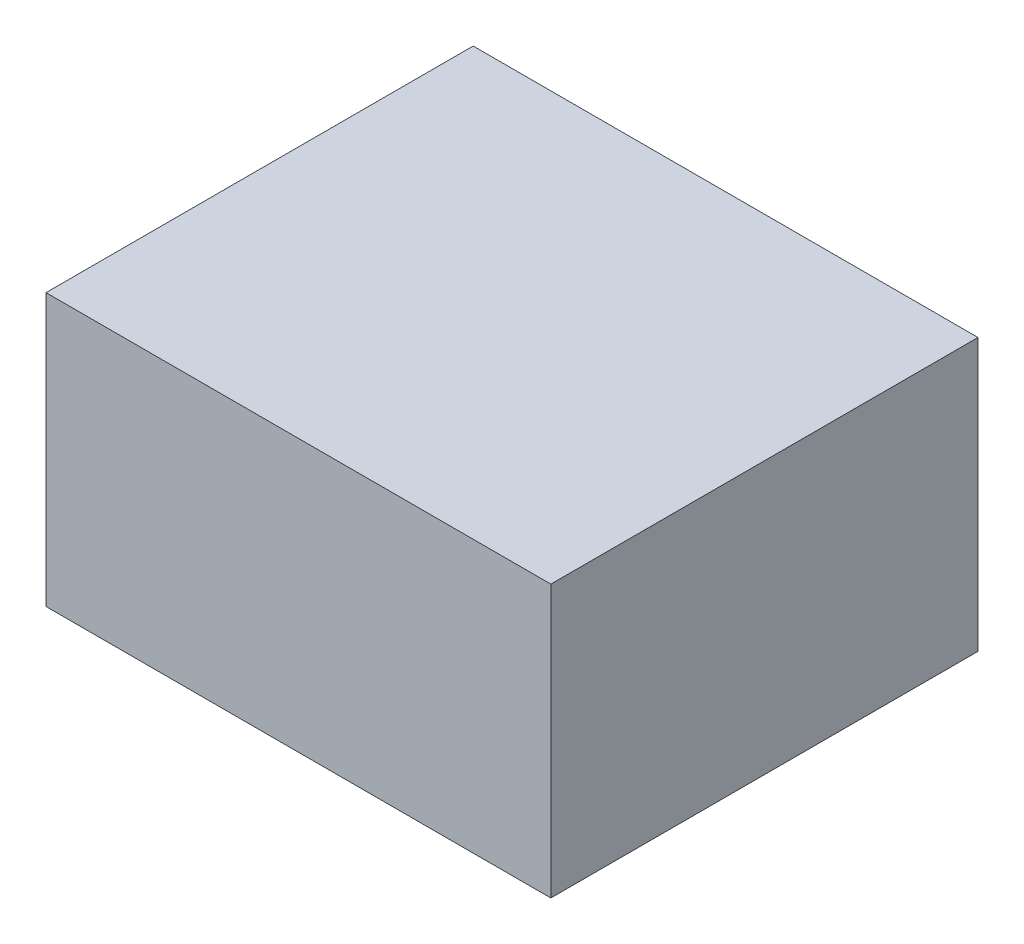
ISO-10303-21;
HEADER;
FILE_DESCRIPTION(('STEP AP214'),'2;1');
FILE_NAME('part.step','',(''),(''),'','','');
FILE_SCHEMA(('AUTOMOTIVE_DESIGN { 1 0 10303 214 1 1 1 1 }'));
ENDSEC;
DATA;
#1=APPLICATION_CONTEXT('core data for automotive mechanical design processes');
#2=APPLICATION_PROTOCOL_DEFINITION('international standard','automotive_design',2000,#1);
#3=PRODUCT_CONTEXT('',#1,'mechanical');
#4=PRODUCT('Part','Part','',(#3));
#5=PRODUCT_RELATED_PRODUCT_CATEGORY('part','',(#4));
#6=PRODUCT_DEFINITION_FORMATION('','',#4);
#7=PRODUCT_DEFINITION_CONTEXT('part definition',#1,'design');
#8=PRODUCT_DEFINITION('design','',#6,#7);
#9=PRODUCT_DEFINITION_SHAPE('','',#8);
#10=(LENGTH_UNIT() NAMED_UNIT(*) SI_UNIT(.MILLI.,.METRE.));
#11=(NAMED_UNIT(*) PLANE_ANGLE_UNIT() SI_UNIT($,.RADIAN.));
#12=(NAMED_UNIT(*) SI_UNIT($,.STERADIAN.) SOLID_ANGLE_UNIT());
#13=UNCERTAINTY_MEASURE_WITH_UNIT(LENGTH_MEASURE(1.E-05),#10,'distance_accuracy_value','');
#14=(GEOMETRIC_REPRESENTATION_CONTEXT(3) GLOBAL_UNCERTAINTY_ASSIGNED_CONTEXT((#13)) GLOBAL_UNIT_ASSIGNED_CONTEXT((#10,
#11,#12)) REPRESENTATION_CONTEXT('',''));
#15=CARTESIAN_POINT('',(0.,0.,0.));
#16=DIRECTION('',(0.,0.,1.));
#17=DIRECTION('',(1.,0.,0.));
#18=AXIS2_PLACEMENT_3D('',#15,#16,#17);
#19=CARTESIAN_POINT('',(0.32500062,0.17500092,0.));
#20=DIRECTION('',(0.,-1.,0.));
#21=DIRECTION('',(0.,0.,-1.));
#22=AXIS2_PLACEMENT_3D('',#19,#20,#21);
#23=PLANE('',#22);
#24=DIRECTION('',(0.,0.,-1.));
#25=VECTOR('',#24,1.);
#26=CARTESIAN_POINT('',(-0.32500062,0.17500092,0.));
#27=LINE('',#26,#25);
#28=CARTESIAN_POINT('',(-0.32500062,0.17500092,0.));
#29=VERTEX_POINT('',#28);
#30=CARTESIAN_POINT('',(-0.32500062,0.17500092,0.5499989));
#31=VERTEX_POINT('',#30);
#32=EDGE_CURVE('E19',#29,#31,#27,.F.);
#33=ORIENTED_EDGE('',*,*,#32,.T.);
#34=DIRECTION('',(-1.,0.,0.));
#35=VECTOR('',#34,1.);
#36=CARTESIAN_POINT('',(-0.32500062,0.17500092,0.5499989));
#37=LINE('',#36,#35);
#38=CARTESIAN_POINT('',(0.32500062,0.17500092,0.5499989));
#39=VERTEX_POINT('',#38);
#40=EDGE_CURVE('E54',#31,#39,#37,.F.);
#41=ORIENTED_EDGE('',*,*,#40,.T.);
#42=DIRECTION('',(0.,0.,1.));
#43=VECTOR('',#42,1.);
#44=CARTESIAN_POINT('',(0.32500062,0.17500092,0.));
#45=LINE('',#44,#43);
#46=CARTESIAN_POINT('',(0.32500062,0.17500092,0.));
#47=VERTEX_POINT('',#46);
#48=EDGE_CURVE('E75',#39,#47,#45,.F.);
#49=ORIENTED_EDGE('',*,*,#48,.T.);
#50=DIRECTION('',(-1.,0.,0.));
#51=VECTOR('',#50,1.);
#52=CARTESIAN_POINT('',(-0.32500062,0.17500092,0.));
#53=LINE('',#52,#51);
#54=EDGE_CURVE('E57',#29,#47,#53,.F.);
#55=ORIENTED_EDGE('',*,*,#54,.F.);
#56=EDGE_LOOP('',(#33,#41,#49,#55));
#57=FACE_BOUND('',#56,.T.);
#58=ADVANCED_FACE('F16',(#57),#23,.F.);
#59=CARTESIAN_POINT('',(-0.32500062,0.17500092,0.));
#60=DIRECTION('',(1.,0.,0.));
#61=DIRECTION('',(0.,0.,-1.));
#62=AXIS2_PLACEMENT_3D('',#59,#60,#61);
#63=PLANE('',#62);
#64=DIRECTION('',(0.,0.,1.));
#65=VECTOR('',#64,1.);
#66=CARTESIAN_POINT('',(-0.32500062,-0.17500092,0.));
#67=LINE('',#66,#65);
#68=CARTESIAN_POINT('',(-0.32500062,-0.17500092,0.));
#69=VERTEX_POINT('',#68);
#70=CARTESIAN_POINT('',(-0.32500062,-0.17500092,0.5499989));
#71=VERTEX_POINT('',#70);
#72=EDGE_CURVE('E72',#69,#71,#67,.T.);
#73=ORIENTED_EDGE('',*,*,#72,.T.);
#74=DIRECTION('',(0.,1.,0.));
#75=VECTOR('',#74,1.);
#76=CARTESIAN_POINT('',(-0.32500062,-0.17500092,0.5499989));
#77=LINE('',#76,#75);
#78=EDGE_CURVE('E62',#71,#31,#77,.T.);
#79=ORIENTED_EDGE('',*,*,#78,.T.);
#80=ORIENTED_EDGE('',*,*,#32,.F.);
#81=DIRECTION('',(0.,1.,0.));
#82=VECTOR('',#81,1.);
#83=CARTESIAN_POINT('',(-0.32500062,-0.17500092,0.));
#84=LINE('',#83,#82);
#85=EDGE_CURVE('E77',#69,#29,#84,.T.);
#86=ORIENTED_EDGE('',*,*,#85,.F.);
#87=EDGE_LOOP('',(#73,#79,#80,#86));
#88=FACE_BOUND('',#87,.T.);
#89=ADVANCED_FACE('F71',(#88),#63,.F.);
#90=CARTESIAN_POINT('',(-0.32500062,-0.17500092,0.5499989));
#91=DIRECTION('',(0.,0.,-1.));
#92=DIRECTION('',(-1.,0.,0.));
#93=AXIS2_PLACEMENT_3D('',#90,#91,#92);
#94=PLANE('',#93);
#95=DIRECTION('',(0.,1.,0.));
#96=VECTOR('',#95,1.);
#97=CARTESIAN_POINT('',(0.32500062,-0.17500092,0.5499989));
#98=LINE('',#97,#96);
#99=CARTESIAN_POINT('',(0.32500062,-0.17500092,0.5499989));
#100=VERTEX_POINT('',#99);
#101=EDGE_CURVE('E68',#100,#39,#98,.T.);
#102=ORIENTED_EDGE('',*,*,#101,.T.);
#103=ORIENTED_EDGE('',*,*,#40,.F.);
#104=ORIENTED_EDGE('',*,*,#78,.F.);
#105=DIRECTION('',(1.,0.,0.));
#106=VECTOR('',#105,1.);
#107=CARTESIAN_POINT('',(-0.32500062,-0.17500092,0.5499989));
#108=LINE('',#107,#106);
#109=EDGE_CURVE('E82',#71,#100,#108,.T.);
#110=ORIENTED_EDGE('',*,*,#109,.T.);
#111=EDGE_LOOP('',(#102,#103,#104,#110));
#112=FACE_BOUND('',#111,.T.);
#113=ADVANCED_FACE('F65',(#112),#94,.F.);
#114=CARTESIAN_POINT('',(0.32500062,-0.17500092,0.));
#115=DIRECTION('',(-1.,0.,0.));
#116=DIRECTION('',(0.,0.,1.));
#117=AXIS2_PLACEMENT_3D('',#114,#115,#116);
#118=PLANE('',#117);
#119=ORIENTED_EDGE('',*,*,#48,.F.);
#120=ORIENTED_EDGE('',*,*,#101,.F.);
#121=DIRECTION('',(0.,0.,1.));
#122=VECTOR('',#121,1.);
#123=CARTESIAN_POINT('',(0.32500062,-0.17500092,0.));
#124=LINE('',#123,#122);
#125=CARTESIAN_POINT('',(0.32500062,-0.17500092,0.));
#126=VERTEX_POINT('',#125);
#127=EDGE_CURVE('E25',#100,#126,#124,.F.);
#128=ORIENTED_EDGE('',*,*,#127,.T.);
#129=DIRECTION('',(0.,1.,0.));
#130=VECTOR('',#129,1.);
#131=CARTESIAN_POINT('',(0.32500062,-0.17500092,0.));
#132=LINE('',#131,#130);
#133=EDGE_CURVE('E33',#47,#126,#132,.F.);
#134=ORIENTED_EDGE('',*,*,#133,.F.);
#135=EDGE_LOOP('',(#119,#120,#128,#134));
#136=FACE_BOUND('',#135,.T.);
#137=ADVANCED_FACE('F87',(#136),#118,.F.);
#138=CARTESIAN_POINT('',(-0.32500062,-0.17500092,0.));
#139=DIRECTION('',(0.,0.,-1.));
#140=DIRECTION('',(-1.,0.,0.));
#141=AXIS2_PLACEMENT_3D('',#138,#139,#140);
#142=PLANE('',#141);
#143=ORIENTED_EDGE('',*,*,#133,.T.);
#144=DIRECTION('',(1.,0.,0.));
#145=VECTOR('',#144,1.);
#146=CARTESIAN_POINT('',(-0.32500062,-0.17500092,0.));
#147=LINE('',#146,#145);
#148=EDGE_CURVE('E11',#126,#69,#147,.F.);
#149=ORIENTED_EDGE('',*,*,#148,.T.);
#150=ORIENTED_EDGE('',*,*,#85,.T.);
#151=ORIENTED_EDGE('',*,*,#54,.T.);
#152=EDGE_LOOP('',(#143,#149,#150,#151));
#153=FACE_BOUND('',#152,.T.);
#154=ADVANCED_FACE('F90',(#153),#142,.T.);
#155=CARTESIAN_POINT('',(-0.32500062,-0.17500092,0.));
#156=DIRECTION('',(0.,1.,0.));
#157=DIRECTION('',(0.,0.,1.));
#158=AXIS2_PLACEMENT_3D('',#155,#156,#157);
#159=PLANE('',#158);
#160=ORIENTED_EDGE('',*,*,#127,.F.);
#161=ORIENTED_EDGE('',*,*,#109,.F.);
#162=ORIENTED_EDGE('',*,*,#72,.F.);
#163=ORIENTED_EDGE('',*,*,#148,.F.);
#164=EDGE_LOOP('',(#160,#161,#162,#163));
#165=FACE_BOUND('',#164,.T.);
#166=ADVANCED_FACE('F89',(#165),#159,.F.);
#167=CLOSED_SHELL('',(#58,#89,#113,#137,#154,#166));
#168=MANIFOLD_SOLID_BREP('B1',#167);
#169=ADVANCED_BREP_SHAPE_REPRESENTATION('',(#18,#168),#14);
#170=SHAPE_DEFINITION_REPRESENTATION(#9,#169);
ENDSEC;
END-ISO-10303-21;
